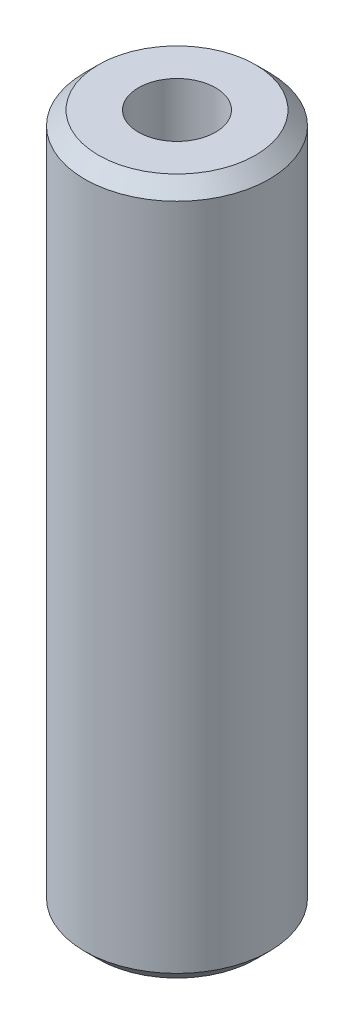
ISO-10303-21;
HEADER;
FILE_DESCRIPTION(('STEP AP214'),'2;1');
FILE_NAME('part.step','',(''),(''),'','','');
FILE_SCHEMA(('AUTOMOTIVE_DESIGN { 1 0 10303 214 1 1 1 1 }'));
ENDSEC;
DATA;
#1=APPLICATION_CONTEXT('core data for automotive mechanical design processes');
#2=APPLICATION_PROTOCOL_DEFINITION('international standard','automotive_design',2000,#1);
#3=PRODUCT_CONTEXT('',#1,'mechanical');
#4=PRODUCT('Part','Part','',(#3));
#5=PRODUCT_RELATED_PRODUCT_CATEGORY('part','',(#4));
#6=PRODUCT_DEFINITION_FORMATION('','',#4);
#7=PRODUCT_DEFINITION_CONTEXT('part definition',#1,'design');
#8=PRODUCT_DEFINITION('design','',#6,#7);
#9=PRODUCT_DEFINITION_SHAPE('','',#8);
#10=(LENGTH_UNIT() NAMED_UNIT(*) SI_UNIT(.MILLI.,.METRE.));
#11=(NAMED_UNIT(*) PLANE_ANGLE_UNIT() SI_UNIT($,.RADIAN.));
#12=(NAMED_UNIT(*) SI_UNIT($,.STERADIAN.) SOLID_ANGLE_UNIT());
#13=UNCERTAINTY_MEASURE_WITH_UNIT(LENGTH_MEASURE(1.E-05),#10,'distance_accuracy_value','');
#14=(GEOMETRIC_REPRESENTATION_CONTEXT(3) GLOBAL_UNCERTAINTY_ASSIGNED_CONTEXT((#13)) GLOBAL_UNIT_ASSIGNED_CONTEXT((#10,
#11,#12)) REPRESENTATION_CONTEXT('',''));
#15=CARTESIAN_POINT('',(0.,0.,0.));
#16=DIRECTION('',(0.,0.,1.));
#17=DIRECTION('',(1.,0.,0.));
#18=AXIS2_PLACEMENT_3D('',#15,#16,#17);
#19=CARTESIAN_POINT('',(0.,226.332338019129,0.));
#20=DIRECTION('',(0.,-1.,0.));
#21=DIRECTION('',(0.,0.,-1.));
#22=AXIS2_PLACEMENT_3D('',#19,#20,#21);
#23=CYLINDRICAL_SURFACE('',#22,30.);
#24=CARTESIAN_POINT('',(0.,221.841403966685,0.));
#25=DIRECTION('',(0.,1.,0.));
#26=DIRECTION('',(0.,0.,1.));
#27=AXIS2_PLACEMENT_3D('',#24,#25,#26);
#28=CIRCLE('',#27,30.);
#29=CARTESIAN_POINT('',(0.,221.841403966685,30.));
#30=VERTEX_POINT('',#29);
#31=EDGE_CURVE('E50',#30,#30,#28,.F.);
#32=ORIENTED_EDGE('',*,*,#31,.T.);
#33=EDGE_LOOP('',(#32));
#34=FACE_BOUND('',#33,.T.);
#35=CARTESIAN_POINT('',(0.,4.49093405244391,0.));
#36=DIRECTION('',(0.,1.,0.));
#37=DIRECTION('',(0.,0.,1.));
#38=AXIS2_PLACEMENT_3D('',#35,#36,#37);
#39=CIRCLE('',#38,30.);
#40=CARTESIAN_POINT('',(0.,4.49093405244391,30.));
#41=VERTEX_POINT('',#40);
#42=EDGE_CURVE('E51',#41,#41,#39,.T.);
#43=ORIENTED_EDGE('',*,*,#42,.T.);
#44=EDGE_LOOP('',(#43));
#45=FACE_BOUND('',#44,.T.);
#46=ADVANCED_FACE('F39',(#34,#45),#23,.T.);
#47=CARTESIAN_POINT('',(0.,226.332338019129,0.));
#48=DIRECTION('',(0.,1.,0.));
#49=DIRECTION('',(0.,0.,1.));
#50=AXIS2_PLACEMENT_3D('',#47,#48,#49);
#51=PLANE('',#50);
#52=CARTESIAN_POINT('',(0.,226.332338019129,0.));
#53=DIRECTION('',(0.,1.,0.));
#54=DIRECTION('',(0.,0.,1.));
#55=AXIS2_PLACEMENT_3D('',#52,#53,#54);
#56=CIRCLE('',#55,25.509065947556);
#57=CARTESIAN_POINT('',(0.,226.332338019129,25.509065947556));
#58=VERTEX_POINT('',#57);
#59=EDGE_CURVE('E54',#58,#58,#56,.T.);
#60=ORIENTED_EDGE('',*,*,#59,.T.);
#61=EDGE_LOOP('',(#60));
#62=FACE_BOUND('',#61,.T.);
#63=CARTESIAN_POINT('',(0.,226.332338019129,0.));
#64=DIRECTION('',(0.,1.,0.));
#65=DIRECTION('',(0.,0.,1.));
#66=AXIS2_PLACEMENT_3D('',#63,#64,#65);
#67=CIRCLE('',#66,12.5357423275641);
#68=CARTESIAN_POINT('',(0.,226.332338019129,12.5357423275641));
#69=VERTEX_POINT('',#68);
#70=EDGE_CURVE('E58',#69,#69,#67,.T.);
#71=ORIENTED_EDGE('',*,*,#70,.F.);
#72=EDGE_LOOP('',(#71));
#73=FACE_BOUND('',#72,.T.);
#74=ADVANCED_FACE('F69',(#62,#73),#51,.T.);
#75=CARTESIAN_POINT('',(0.,0.,0.));
#76=DIRECTION('',(0.,1.,0.));
#77=DIRECTION('',(0.,0.,1.));
#78=AXIS2_PLACEMENT_3D('',#75,#76,#77);
#79=PLANE('',#78);
#80=CARTESIAN_POINT('',(0.,0.,0.));
#81=DIRECTION('',(0.,1.,0.));
#82=DIRECTION('',(0.,0.,1.));
#83=AXIS2_PLACEMENT_3D('',#80,#81,#82);
#84=CIRCLE('',#83,25.5090659475561);
#85=CARTESIAN_POINT('',(0.,0.,25.5090659475561));
#86=VERTEX_POINT('',#85);
#87=EDGE_CURVE('E10',#86,#86,#84,.F.);
#88=ORIENTED_EDGE('',*,*,#87,.T.);
#89=EDGE_LOOP('',(#88));
#90=FACE_BOUND('',#89,.T.);
#91=CARTESIAN_POINT('',(0.,0.,0.));
#92=DIRECTION('',(0.,1.,0.));
#93=DIRECTION('',(0.,0.,1.));
#94=AXIS2_PLACEMENT_3D('',#91,#92,#93);
#95=CIRCLE('',#94,12.5357423275641);
#96=CARTESIAN_POINT('',(0.,0.,12.5357423275641));
#97=VERTEX_POINT('',#96);
#98=EDGE_CURVE('E63',#97,#97,#95,.T.);
#99=ORIENTED_EDGE('',*,*,#98,.T.);
#100=EDGE_LOOP('',(#99));
#101=FACE_BOUND('',#100,.T.);
#102=ADVANCED_FACE('F75',(#90,#101),#79,.F.);
#103=CARTESIAN_POINT('',(0.,226.332338019129,0.));
#104=DIRECTION('',(0.,-1.,0.));
#105=DIRECTION('',(0.,0.,-1.));
#106=AXIS2_PLACEMENT_3D('',#103,#104,#105);
#107=CYLINDRICAL_SURFACE('',#106,12.5357423275641);
#108=ORIENTED_EDGE('',*,*,#70,.T.);
#109=EDGE_LOOP('',(#108));
#110=FACE_BOUND('',#109,.T.);
#111=ORIENTED_EDGE('',*,*,#98,.F.);
#112=EDGE_LOOP('',(#111));
#113=FACE_BOUND('',#112,.T.);
#114=ADVANCED_FACE('F70',(#110,#113),#107,.F.);
#115=CARTESIAN_POINT('',(0.,226.332338019129,0.));
#116=DIRECTION('',(0.,-1.,0.));
#117=DIRECTION('',(0.,0.,-1.));
#118=AXIS2_PLACEMENT_3D('',#115,#116,#117);
#119=CONICAL_SURFACE('',#118,25.509065947556,0.785398163397445);
#120=ORIENTED_EDGE('',*,*,#31,.F.);
#121=EDGE_LOOP('',(#120));
#122=FACE_BOUND('',#121,.T.);
#123=ORIENTED_EDGE('',*,*,#59,.F.);
#124=EDGE_LOOP('',(#123));
#125=FACE_BOUND('',#124,.T.);
#126=ADVANCED_FACE('F81',(#122,#125),#119,.T.);
#127=CARTESIAN_POINT('',(0.,4.49093405244391,0.));
#128=DIRECTION('',(0.,1.,0.));
#129=DIRECTION('',(0.,0.,1.));
#130=AXIS2_PLACEMENT_3D('',#127,#128,#129);
#131=CONICAL_SURFACE('',#130,30.,0.785398163397451);
#132=ORIENTED_EDGE('',*,*,#87,.F.);
#133=EDGE_LOOP('',(#132));
#134=FACE_BOUND('',#133,.T.);
#135=ORIENTED_EDGE('',*,*,#42,.F.);
#136=EDGE_LOOP('',(#135));
#137=FACE_BOUND('',#136,.T.);
#138=ADVANCED_FACE('F45',(#134,#137),#131,.T.);
#139=CLOSED_SHELL('',(#46,#74,#102,#114,#126,#138));
#140=MANIFOLD_SOLID_BREP('B2',#139);
#141=ADVANCED_BREP_SHAPE_REPRESENTATION('',(#18,#140),#14);
#142=SHAPE_DEFINITION_REPRESENTATION(#9,#141);
ENDSEC;
END-ISO-10303-21;
